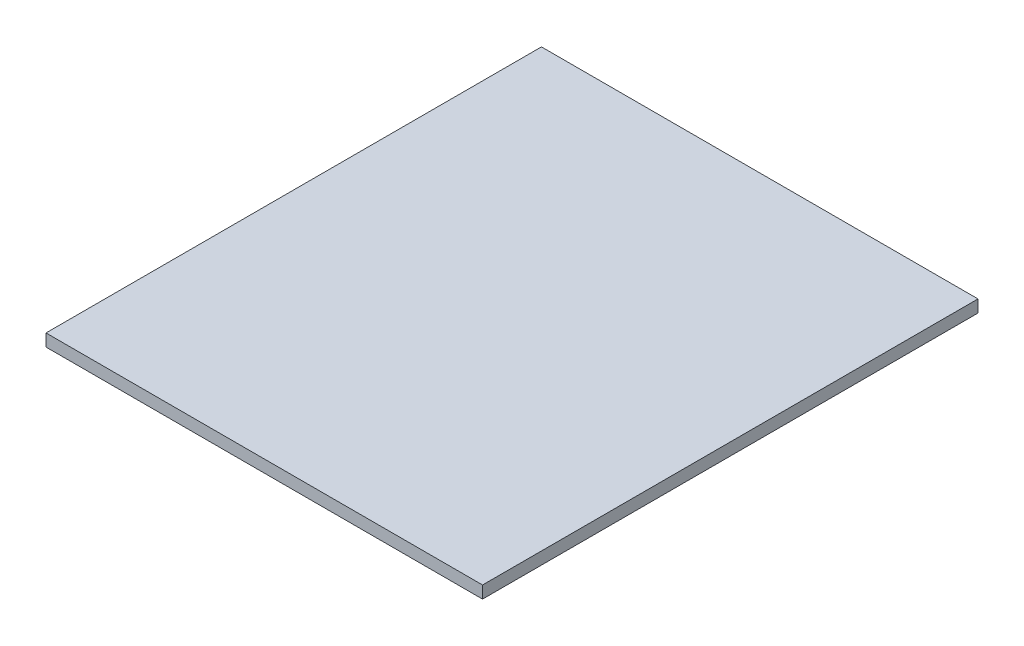
ISO-10303-21;
HEADER;
FILE_DESCRIPTION(('STEP AP214'),'2;1');
FILE_NAME('part.step','',(''),(''),'','','');
FILE_SCHEMA(('AUTOMOTIVE_DESIGN { 1 0 10303 214 1 1 1 1 }'));
ENDSEC;
DATA;
#1=APPLICATION_CONTEXT('core data for automotive mechanical design processes');
#2=APPLICATION_PROTOCOL_DEFINITION('international standard','automotive_design',2000,#1);
#3=PRODUCT_CONTEXT('',#1,'mechanical');
#4=PRODUCT('Part','Part','',(#3));
#5=PRODUCT_RELATED_PRODUCT_CATEGORY('part','',(#4));
#6=PRODUCT_DEFINITION_FORMATION('','',#4);
#7=PRODUCT_DEFINITION_CONTEXT('part definition',#1,'design');
#8=PRODUCT_DEFINITION('design','',#6,#7);
#9=PRODUCT_DEFINITION_SHAPE('','',#8);
#10=(LENGTH_UNIT() NAMED_UNIT(*) SI_UNIT(.MILLI.,.METRE.));
#11=(NAMED_UNIT(*) PLANE_ANGLE_UNIT() SI_UNIT($,.RADIAN.));
#12=(NAMED_UNIT(*) SI_UNIT($,.STERADIAN.) SOLID_ANGLE_UNIT());
#13=UNCERTAINTY_MEASURE_WITH_UNIT(LENGTH_MEASURE(1.E-05),#10,'distance_accuracy_value','');
#14=(GEOMETRIC_REPRESENTATION_CONTEXT(3) GLOBAL_UNCERTAINTY_ASSIGNED_CONTEXT((#13)) GLOBAL_UNIT_ASSIGNED_CONTEXT((#10,
#11,#12)) REPRESENTATION_CONTEXT('',''));
#15=CARTESIAN_POINT('',(0.,0.,0.));
#16=DIRECTION('',(0.,0.,1.));
#17=DIRECTION('',(1.,0.,0.));
#18=AXIS2_PLACEMENT_3D('',#15,#16,#17);
#19=CARTESIAN_POINT('',(1130.173,63.5,-1282.7));
#20=DIRECTION('',(-1.,0.,0.));
#21=DIRECTION('',(0.,0.,1.));
#22=AXIS2_PLACEMENT_3D('',#19,#20,#21);
#23=PLANE('',#22);
#24=DIRECTION('',(0.,0.,-1.));
#25=VECTOR('',#24,1.);
#26=CARTESIAN_POINT('',(1130.173,0.,-1282.7));
#27=LINE('',#26,#25);
#28=CARTESIAN_POINT('',(1130.173,0.,1282.7));
#29=VERTEX_POINT('',#28);
#30=CARTESIAN_POINT('',(1130.173,0.,-1282.7));
#31=VERTEX_POINT('',#30);
#32=EDGE_CURVE('E103',#29,#31,#27,.T.);
#33=ORIENTED_EDGE('',*,*,#32,.T.);
#34=DIRECTION('',(0.,-1.,0.));
#35=VECTOR('',#34,1.);
#36=CARTESIAN_POINT('',(1130.173,63.5,-1282.7));
#37=LINE('',#36,#35);
#38=CARTESIAN_POINT('',(1130.173,63.5,-1282.7));
#39=VERTEX_POINT('',#38);
#40=EDGE_CURVE('E11',#39,#31,#37,.T.);
#41=ORIENTED_EDGE('',*,*,#40,.F.);
#42=DIRECTION('',(0.,0.,-1.));
#43=VECTOR('',#42,1.);
#44=CARTESIAN_POINT('',(1130.173,63.5,-1282.7));
#45=LINE('',#44,#43);
#46=CARTESIAN_POINT('',(1130.173,63.5,1282.7));
#47=VERTEX_POINT('',#46);
#48=EDGE_CURVE('E91',#47,#39,#45,.T.);
#49=ORIENTED_EDGE('',*,*,#48,.F.);
#50=DIRECTION('',(0.,-1.,0.));
#51=VECTOR('',#50,1.);
#52=CARTESIAN_POINT('',(1130.173,63.5,1282.7));
#53=LINE('',#52,#51);
#54=EDGE_CURVE('E99',#47,#29,#53,.T.);
#55=ORIENTED_EDGE('',*,*,#54,.T.);
#56=EDGE_LOOP('',(#33,#41,#49,#55));
#57=FACE_BOUND('',#56,.T.);
#58=ADVANCED_FACE('F40',(#57),#23,.F.);
#59=CARTESIAN_POINT('',(-1130.173,63.5,-1282.7));
#60=DIRECTION('',(0.,0.,1.));
#61=DIRECTION('',(1.,0.,0.));
#62=AXIS2_PLACEMENT_3D('',#59,#60,#61);
#63=PLANE('',#62);
#64=DIRECTION('',(-1.,0.,0.));
#65=VECTOR('',#64,1.);
#66=CARTESIAN_POINT('',(-1130.173,0.,-1282.7));
#67=LINE('',#66,#65);
#68=CARTESIAN_POINT('',(-1130.173,0.,-1282.7));
#69=VERTEX_POINT('',#68);
#70=EDGE_CURVE('E95',#31,#69,#67,.T.);
#71=ORIENTED_EDGE('',*,*,#70,.T.);
#72=DIRECTION('',(0.,-1.,0.));
#73=VECTOR('',#72,1.);
#74=CARTESIAN_POINT('',(-1130.173,63.5,-1282.7));
#75=LINE('',#74,#73);
#76=CARTESIAN_POINT('',(-1130.173,63.5,-1282.7));
#77=VERTEX_POINT('',#76);
#78=EDGE_CURVE('E48',#77,#69,#75,.T.);
#79=ORIENTED_EDGE('',*,*,#78,.F.);
#80=DIRECTION('',(-1.,0.,0.));
#81=VECTOR('',#80,1.);
#82=CARTESIAN_POINT('',(-1130.173,63.5,-1282.7));
#83=LINE('',#82,#81);
#84=EDGE_CURVE('E86',#39,#77,#83,.T.);
#85=ORIENTED_EDGE('',*,*,#84,.F.);
#86=ORIENTED_EDGE('',*,*,#40,.T.);
#87=EDGE_LOOP('',(#71,#79,#85,#86));
#88=FACE_BOUND('',#87,.T.);
#89=ADVANCED_FACE('F94',(#88),#63,.F.);
#90=CARTESIAN_POINT('',(-1130.173,63.5,-1282.7));
#91=DIRECTION('',(1.,0.,0.));
#92=DIRECTION('',(0.,0.,-1.));
#93=AXIS2_PLACEMENT_3D('',#90,#91,#92);
#94=PLANE('',#93);
#95=DIRECTION('',(0.,0.,1.));
#96=VECTOR('',#95,1.);
#97=CARTESIAN_POINT('',(-1130.173,0.,-1282.7));
#98=LINE('',#97,#96);
#99=CARTESIAN_POINT('',(-1130.173,0.,1282.7));
#100=VERTEX_POINT('',#99);
#101=EDGE_CURVE('E73',#69,#100,#98,.T.);
#102=ORIENTED_EDGE('',*,*,#101,.T.);
#103=DIRECTION('',(0.,-1.,0.));
#104=VECTOR('',#103,1.);
#105=CARTESIAN_POINT('',(-1130.173,63.5,1282.7));
#106=LINE('',#105,#104);
#107=CARTESIAN_POINT('',(-1130.173,63.5,1282.7));
#108=VERTEX_POINT('',#107);
#109=EDGE_CURVE('E96',#108,#100,#106,.T.);
#110=ORIENTED_EDGE('',*,*,#109,.F.);
#111=DIRECTION('',(0.,0.,1.));
#112=VECTOR('',#111,1.);
#113=CARTESIAN_POINT('',(-1130.173,63.5,-1282.7));
#114=LINE('',#113,#112);
#115=EDGE_CURVE('E89',#77,#108,#114,.T.);
#116=ORIENTED_EDGE('',*,*,#115,.F.);
#117=ORIENTED_EDGE('',*,*,#78,.T.);
#118=EDGE_LOOP('',(#102,#110,#116,#117));
#119=FACE_BOUND('',#118,.T.);
#120=ADVANCED_FACE('F97',(#119),#94,.F.);
#121=CARTESIAN_POINT('',(-1130.173,63.5,1282.7));
#122=DIRECTION('',(0.,0.,-1.));
#123=DIRECTION('',(-1.,0.,0.));
#124=AXIS2_PLACEMENT_3D('',#121,#122,#123);
#125=PLANE('',#124);
#126=DIRECTION('',(1.,0.,0.));
#127=VECTOR('',#126,1.);
#128=CARTESIAN_POINT('',(-1130.173,0.,1282.7));
#129=LINE('',#128,#127);
#130=EDGE_CURVE('E79',#100,#29,#129,.T.);
#131=ORIENTED_EDGE('',*,*,#130,.T.);
#132=ORIENTED_EDGE('',*,*,#54,.F.);
#133=DIRECTION('',(1.,0.,0.));
#134=VECTOR('',#133,1.);
#135=CARTESIAN_POINT('',(-1130.173,63.5,1282.7));
#136=LINE('',#135,#134);
#137=EDGE_CURVE('E56',#108,#47,#136,.T.);
#138=ORIENTED_EDGE('',*,*,#137,.F.);
#139=ORIENTED_EDGE('',*,*,#109,.T.);
#140=EDGE_LOOP('',(#131,#132,#138,#139));
#141=FACE_BOUND('',#140,.T.);
#142=ADVANCED_FACE('F110',(#141),#125,.F.);
#143=CARTESIAN_POINT('',(0.,63.5,0.));
#144=DIRECTION('',(0.,1.,0.));
#145=DIRECTION('',(0.,0.,1.));
#146=AXIS2_PLACEMENT_3D('',#143,#144,#145);
#147=PLANE('',#146);
#148=ORIENTED_EDGE('',*,*,#48,.T.);
#149=ORIENTED_EDGE('',*,*,#84,.T.);
#150=ORIENTED_EDGE('',*,*,#115,.T.);
#151=ORIENTED_EDGE('',*,*,#137,.T.);
#152=EDGE_LOOP('',(#148,#149,#150,#151));
#153=FACE_BOUND('',#152,.T.);
#154=ADVANCED_FACE('F87',(#153),#147,.T.);
#155=CARTESIAN_POINT('',(0.,0.,0.));
#156=DIRECTION('',(0.,1.,0.));
#157=DIRECTION('',(0.,0.,1.));
#158=AXIS2_PLACEMENT_3D('',#155,#156,#157);
#159=PLANE('',#158);
#160=ORIENTED_EDGE('',*,*,#32,.F.);
#161=ORIENTED_EDGE('',*,*,#130,.F.);
#162=ORIENTED_EDGE('',*,*,#101,.F.);
#163=ORIENTED_EDGE('',*,*,#70,.F.);
#164=EDGE_LOOP('',(#160,#161,#162,#163));
#165=FACE_BOUND('',#164,.T.);
#166=ADVANCED_FACE('F113',(#165),#159,.F.);
#167=CLOSED_SHELL('',(#58,#89,#120,#142,#154,#166));
#168=MANIFOLD_SOLID_BREP('B2',#167);
#169=ADVANCED_BREP_SHAPE_REPRESENTATION('',(#18,#168),#14);
#170=SHAPE_DEFINITION_REPRESENTATION(#9,#169);
ENDSEC;
END-ISO-10303-21;
